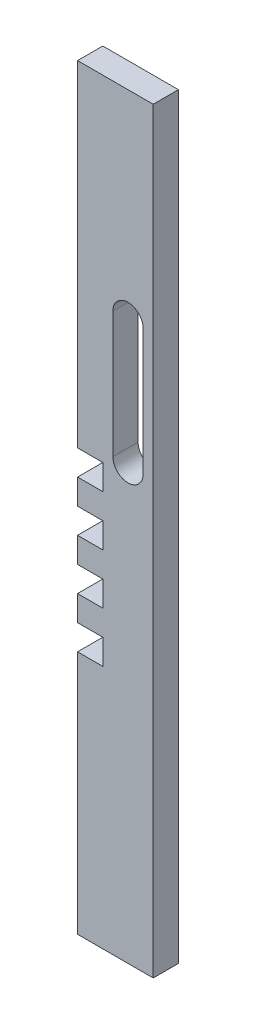
ISO-10303-21;
HEADER;
FILE_DESCRIPTION(('STEP AP214'),'2;1');
FILE_NAME('part.step','',(''),(''),'','','');
FILE_SCHEMA(('AUTOMOTIVE_DESIGN { 1 0 10303 214 1 1 1 1 }'));
ENDSEC;
DATA;
#1=APPLICATION_CONTEXT('core data for automotive mechanical design processes');
#2=APPLICATION_PROTOCOL_DEFINITION('international standard','automotive_design',2000,#1);
#3=PRODUCT_CONTEXT('',#1,'mechanical');
#4=PRODUCT('Part','Part','',(#3));
#5=PRODUCT_RELATED_PRODUCT_CATEGORY('part','',(#4));
#6=PRODUCT_DEFINITION_FORMATION('','',#4);
#7=PRODUCT_DEFINITION_CONTEXT('part definition',#1,'design');
#8=PRODUCT_DEFINITION('design','',#6,#7);
#9=PRODUCT_DEFINITION_SHAPE('','',#8);
#10=(LENGTH_UNIT() NAMED_UNIT(*) SI_UNIT(.MILLI.,.METRE.));
#11=(NAMED_UNIT(*) PLANE_ANGLE_UNIT() SI_UNIT($,.RADIAN.));
#12=(NAMED_UNIT(*) SI_UNIT($,.STERADIAN.) SOLID_ANGLE_UNIT());
#13=UNCERTAINTY_MEASURE_WITH_UNIT(LENGTH_MEASURE(1.E-05),#10,'distance_accuracy_value','');
#14=(GEOMETRIC_REPRESENTATION_CONTEXT(3) GLOBAL_UNCERTAINTY_ASSIGNED_CONTEXT((#13)) GLOBAL_UNIT_ASSIGNED_CONTEXT((#10,
#11,#12)) REPRESENTATION_CONTEXT('',''));
#15=CARTESIAN_POINT('',(0.,0.,0.));
#16=DIRECTION('',(0.,0.,1.));
#17=DIRECTION('',(1.,0.,0.));
#18=AXIS2_PLACEMENT_3D('',#15,#16,#17);
#19=CARTESIAN_POINT('',(-30.,0.,10.));
#20=DIRECTION('',(1.,0.,0.));
#21=DIRECTION('',(0.,0.,-1.));
#22=AXIS2_PLACEMENT_3D('',#19,#20,#21);
#23=PLANE('',#22);
#24=DIRECTION('',(0.,-1.,0.));
#25=VECTOR('',#24,1.);
#26=CARTESIAN_POINT('',(-30.,0.,0.));
#27=LINE('',#26,#25);
#28=CARTESIAN_POINT('',(-30.,117.,0.));
#29=VERTEX_POINT('',#28);
#30=CARTESIAN_POINT('',(-30.,107.,0.));
#31=VERTEX_POINT('',#30);
#32=EDGE_CURVE('E394',#29,#31,#27,.T.);
#33=ORIENTED_EDGE('',*,*,#32,.T.);
#34=DIRECTION('',(0.,0.,1.));
#35=VECTOR('',#34,1.);
#36=CARTESIAN_POINT('',(-30.,107.,0.));
#37=LINE('',#36,#35);
#38=CARTESIAN_POINT('',(-30.,107.,10.));
#39=VERTEX_POINT('',#38);
#40=EDGE_CURVE('E248',#31,#39,#37,.T.);
#41=ORIENTED_EDGE('',*,*,#40,.T.);
#42=DIRECTION('',(0.,-1.,0.));
#43=VECTOR('',#42,1.);
#44=CARTESIAN_POINT('',(-30.,0.,10.));
#45=LINE('',#44,#43);
#46=CARTESIAN_POINT('',(-30.,117.,10.));
#47=VERTEX_POINT('',#46);
#48=EDGE_CURVE('E420',#47,#39,#45,.T.);
#49=ORIENTED_EDGE('',*,*,#48,.F.);
#50=DIRECTION('',(0.,0.,1.));
#51=VECTOR('',#50,1.);
#52=CARTESIAN_POINT('',(-30.,117.,0.));
#53=LINE('',#52,#51);
#54=EDGE_CURVE('E267',#29,#47,#53,.T.);
#55=ORIENTED_EDGE('',*,*,#54,.F.);
#56=EDGE_LOOP('',(#33,#41,#49,#55));
#57=FACE_BOUND('',#56,.T.);
#58=ADVANCED_FACE('F33',(#57),#23,.F.);
#59=CARTESIAN_POINT('',(-30.,137.,0.));
#60=VERTEX_POINT('',#59);
#61=CARTESIAN_POINT('',(-30.,127.,0.));
#62=VERTEX_POINT('',#61);
#63=EDGE_CURVE('E396',#60,#62,#27,.T.);
#64=ORIENTED_EDGE('',*,*,#63,.T.);
#65=DIRECTION('',(0.,0.,1.));
#66=VECTOR('',#65,1.);
#67=CARTESIAN_POINT('',(-30.,127.,0.));
#68=LINE('',#67,#66);
#69=CARTESIAN_POINT('',(-30.,127.,10.));
#70=VERTEX_POINT('',#69);
#71=EDGE_CURVE('E274',#62,#70,#68,.T.);
#72=ORIENTED_EDGE('',*,*,#71,.T.);
#73=CARTESIAN_POINT('',(-30.,137.,10.));
#74=VERTEX_POINT('',#73);
#75=EDGE_CURVE('E418',#74,#70,#45,.T.);
#76=ORIENTED_EDGE('',*,*,#75,.F.);
#77=DIRECTION('',(0.,0.,1.));
#78=VECTOR('',#77,1.);
#79=CARTESIAN_POINT('',(-30.,137.,0.));
#80=LINE('',#79,#78);
#81=EDGE_CURVE('E293',#60,#74,#80,.T.);
#82=ORIENTED_EDGE('',*,*,#81,.F.);
#83=EDGE_LOOP('',(#64,#72,#76,#82));
#84=FACE_BOUND('',#83,.T.);
#85=ADVANCED_FACE('F448',(#84),#23,.F.);
#86=CARTESIAN_POINT('',(-30.,157.,0.));
#87=VERTEX_POINT('',#86);
#88=CARTESIAN_POINT('',(-30.,147.,0.));
#89=VERTEX_POINT('',#88);
#90=EDGE_CURVE('E357',#87,#89,#27,.T.);
#91=ORIENTED_EDGE('',*,*,#90,.T.);
#92=DIRECTION('',(0.,0.,1.));
#93=VECTOR('',#92,1.);
#94=CARTESIAN_POINT('',(-30.,147.,0.));
#95=LINE('',#94,#93);
#96=CARTESIAN_POINT('',(-30.,147.,10.));
#97=VERTEX_POINT('',#96);
#98=EDGE_CURVE('E300',#89,#97,#95,.T.);
#99=ORIENTED_EDGE('',*,*,#98,.T.);
#100=CARTESIAN_POINT('',(-30.,157.,10.));
#101=VERTEX_POINT('',#100);
#102=EDGE_CURVE('E346',#101,#97,#45,.T.);
#103=ORIENTED_EDGE('',*,*,#102,.F.);
#104=DIRECTION('',(0.,0.,1.));
#105=VECTOR('',#104,1.);
#106=CARTESIAN_POINT('',(-30.,157.,0.));
#107=LINE('',#106,#105);
#108=EDGE_CURVE('E319',#87,#101,#107,.T.);
#109=ORIENTED_EDGE('',*,*,#108,.F.);
#110=EDGE_LOOP('',(#91,#99,#103,#109));
#111=FACE_BOUND('',#110,.T.);
#112=ADVANCED_FACE('F408',(#111),#23,.F.);
#113=CARTESIAN_POINT('',(-30.,300.,0.));
#114=VERTEX_POINT('',#113);
#115=CARTESIAN_POINT('',(-30.,167.,0.));
#116=VERTEX_POINT('',#115);
#117=EDGE_CURVE('E354',#114,#116,#27,.T.);
#118=ORIENTED_EDGE('',*,*,#117,.T.);
#119=DIRECTION('',(0.,0.,1.));
#120=VECTOR('',#119,1.);
#121=CARTESIAN_POINT('',(-30.,167.,0.));
#122=LINE('',#121,#120);
#123=CARTESIAN_POINT('',(-30.,167.,10.));
#124=VERTEX_POINT('',#123);
#125=EDGE_CURVE('E326',#116,#124,#122,.T.);
#126=ORIENTED_EDGE('',*,*,#125,.T.);
#127=CARTESIAN_POINT('',(-30.,300.,10.));
#128=VERTEX_POINT('',#127);
#129=EDGE_CURVE('E342',#128,#124,#45,.T.);
#130=ORIENTED_EDGE('',*,*,#129,.F.);
#131=DIRECTION('',(0.,0.,-1.));
#132=VECTOR('',#131,1.);
#133=CARTESIAN_POINT('',(-30.,300.,10.));
#134=LINE('',#133,#132);
#135=EDGE_CURVE('E41',#128,#114,#134,.T.);
#136=ORIENTED_EDGE('',*,*,#135,.T.);
#137=EDGE_LOOP('',(#118,#126,#130,#136));
#138=FACE_BOUND('',#137,.T.);
#139=ADVANCED_FACE('F368',(#138),#23,.F.);
#140=CARTESIAN_POINT('',(0.,0.,10.));
#141=DIRECTION('',(-1.,0.,0.));
#142=DIRECTION('',(0.,0.,1.));
#143=AXIS2_PLACEMENT_3D('',#140,#141,#142);
#144=PLANE('',#143);
#145=DIRECTION('',(0.,1.,0.));
#146=VECTOR('',#145,1.);
#147=CARTESIAN_POINT('',(0.,0.,0.));
#148=LINE('',#147,#146);
#149=CARTESIAN_POINT('',(0.,0.,0.));
#150=VERTEX_POINT('',#149);
#151=CARTESIAN_POINT('',(0.,300.,0.));
#152=VERTEX_POINT('',#151);
#153=EDGE_CURVE('E329',#150,#152,#148,.T.);
#154=ORIENTED_EDGE('',*,*,#153,.T.);
#155=DIRECTION('',(0.,0.,-1.));
#156=VECTOR('',#155,1.);
#157=CARTESIAN_POINT('',(0.,300.,10.));
#158=LINE('',#157,#156);
#159=CARTESIAN_POINT('',(0.,300.,10.));
#160=VERTEX_POINT('',#159);
#161=EDGE_CURVE('E11',#160,#152,#158,.T.);
#162=ORIENTED_EDGE('',*,*,#161,.F.);
#163=DIRECTION('',(0.,1.,0.));
#164=VECTOR('',#163,1.);
#165=CARTESIAN_POINT('',(0.,0.,10.));
#166=LINE('',#165,#164);
#167=CARTESIAN_POINT('',(0.,0.,10.));
#168=VERTEX_POINT('',#167);
#169=EDGE_CURVE('E335',#168,#160,#166,.T.);
#170=ORIENTED_EDGE('',*,*,#169,.F.);
#171=DIRECTION('',(0.,0.,-1.));
#172=VECTOR('',#171,1.);
#173=CARTESIAN_POINT('',(0.,0.,10.));
#174=LINE('',#173,#172);
#175=EDGE_CURVE('E348',#168,#150,#174,.T.);
#176=ORIENTED_EDGE('',*,*,#175,.T.);
#177=EDGE_LOOP('',(#154,#162,#170,#176));
#178=FACE_BOUND('',#177,.T.);
#179=ADVANCED_FACE('F35',(#178),#144,.F.);
#180=CARTESIAN_POINT('',(0.,300.,10.));
#181=DIRECTION('',(0.,-1.,0.));
#182=DIRECTION('',(0.,0.,-1.));
#183=AXIS2_PLACEMENT_3D('',#180,#181,#182);
#184=PLANE('',#183);
#185=DIRECTION('',(-1.,0.,0.));
#186=VECTOR('',#185,1.);
#187=CARTESIAN_POINT('',(0.,300.,0.));
#188=LINE('',#187,#186);
#189=EDGE_CURVE('E351',#152,#114,#188,.T.);
#190=ORIENTED_EDGE('',*,*,#189,.T.);
#191=ORIENTED_EDGE('',*,*,#135,.F.);
#192=DIRECTION('',(-1.,0.,0.));
#193=VECTOR('',#192,1.);
#194=CARTESIAN_POINT('',(0.,300.,10.));
#195=LINE('',#194,#193);
#196=EDGE_CURVE('E338',#160,#128,#195,.T.);
#197=ORIENTED_EDGE('',*,*,#196,.F.);
#198=ORIENTED_EDGE('',*,*,#161,.T.);
#199=EDGE_LOOP('',(#190,#191,#197,#198));
#200=FACE_BOUND('',#199,.T.);
#201=ADVANCED_FACE('F381',(#200),#184,.F.);
#202=CARTESIAN_POINT('',(-30.,97.,10.));
#203=VERTEX_POINT('',#202);
#204=CARTESIAN_POINT('',(-30.,0.,10.));
#205=VERTEX_POINT('',#204);
#206=EDGE_CURVE('E341',#203,#205,#45,.T.);
#207=ORIENTED_EDGE('',*,*,#206,.F.);
#208=DIRECTION('',(0.,0.,1.));
#209=VECTOR('',#208,1.);
#210=CARTESIAN_POINT('',(-30.,97.,0.));
#211=LINE('',#210,#209);
#212=CARTESIAN_POINT('',(-30.,97.,0.));
#213=VERTEX_POINT('',#212);
#214=EDGE_CURVE('E241',#213,#203,#211,.T.);
#215=ORIENTED_EDGE('',*,*,#214,.F.);
#216=CARTESIAN_POINT('',(-30.,0.,0.));
#217=VERTEX_POINT('',#216);
#218=EDGE_CURVE('E353',#213,#217,#27,.T.);
#219=ORIENTED_EDGE('',*,*,#218,.T.);
#220=DIRECTION('',(0.,0.,-1.));
#221=VECTOR('',#220,1.);
#222=CARTESIAN_POINT('',(-30.,0.,10.));
#223=LINE('',#222,#221);
#224=EDGE_CURVE('E361',#205,#217,#223,.T.);
#225=ORIENTED_EDGE('',*,*,#224,.F.);
#226=EDGE_LOOP('',(#207,#215,#219,#225));
#227=FACE_BOUND('',#226,.T.);
#228=ADVANCED_FACE('F392',(#227),#23,.F.);
#229=CARTESIAN_POINT('',(0.,0.,10.));
#230=DIRECTION('',(0.,1.,0.));
#231=DIRECTION('',(0.,0.,1.));
#232=AXIS2_PLACEMENT_3D('',#229,#230,#231);
#233=PLANE('',#232);
#234=DIRECTION('',(1.,0.,0.));
#235=VECTOR('',#234,1.);
#236=CARTESIAN_POINT('',(0.,0.,0.));
#237=LINE('',#236,#235);
#238=EDGE_CURVE('E339',#217,#150,#237,.T.);
#239=ORIENTED_EDGE('',*,*,#238,.T.);
#240=ORIENTED_EDGE('',*,*,#175,.F.);
#241=DIRECTION('',(1.,0.,0.));
#242=VECTOR('',#241,1.);
#243=CARTESIAN_POINT('',(0.,0.,10.));
#244=LINE('',#243,#242);
#245=EDGE_CURVE('E345',#205,#168,#244,.T.);
#246=ORIENTED_EDGE('',*,*,#245,.F.);
#247=ORIENTED_EDGE('',*,*,#224,.T.);
#248=EDGE_LOOP('',(#239,#240,#246,#247));
#249=FACE_BOUND('',#248,.T.);
#250=ADVANCED_FACE('F387',(#249),#233,.F.);
#251=CARTESIAN_POINT('',(0.,0.,10.));
#252=DIRECTION('',(0.,0.,1.));
#253=DIRECTION('',(1.,0.,0.));
#254=AXIS2_PLACEMENT_3D('',#251,#252,#253);
#255=PLANE('',#254);
#256=CARTESIAN_POINT('',(-10.,171.,10.));
#257=DIRECTION('',(0.,0.,1.));
#258=DIRECTION('',(1.,0.,0.));
#259=AXIS2_PLACEMENT_3D('',#256,#257,#258);
#260=CIRCLE('',#259,6.);
#261=CARTESIAN_POINT('',(-16.,171.,10.));
#262=VERTEX_POINT('',#261);
#263=CARTESIAN_POINT('',(-4.,171.,10.));
#264=VERTEX_POINT('',#263);
#265=EDGE_CURVE('E48',#262,#264,#260,.T.);
#266=ORIENTED_EDGE('',*,*,#265,.F.);
#267=DIRECTION('',(0.,-1.,0.));
#268=VECTOR('',#267,1.);
#269=CARTESIAN_POINT('',(-16.,221.,10.));
#270=LINE('',#269,#268);
#271=CARTESIAN_POINT('',(-16.,221.,10.));
#272=VERTEX_POINT('',#271);
#273=EDGE_CURVE('E212',#272,#262,#270,.T.);
#274=ORIENTED_EDGE('',*,*,#273,.F.);
#275=CARTESIAN_POINT('',(-10.,221.,10.));
#276=DIRECTION('',(0.,0.,1.));
#277=DIRECTION('',(-1.,0.,0.));
#278=AXIS2_PLACEMENT_3D('',#275,#276,#277);
#279=CIRCLE('',#278,6.);
#280=CARTESIAN_POINT('',(-4.,221.,10.));
#281=VERTEX_POINT('',#280);
#282=EDGE_CURVE('E215',#281,#272,#279,.T.);
#283=ORIENTED_EDGE('',*,*,#282,.F.);
#284=DIRECTION('',(0.,1.,0.));
#285=VECTOR('',#284,1.);
#286=CARTESIAN_POINT('',(-4.,171.,10.));
#287=LINE('',#286,#285);
#288=EDGE_CURVE('E221',#264,#281,#287,.T.);
#289=ORIENTED_EDGE('',*,*,#288,.F.);
#290=EDGE_LOOP('',(#266,#274,#283,#289));
#291=FACE_BOUND('',#290,.T.);
#292=DIRECTION('',(-1.,0.,0.));
#293=VECTOR('',#292,1.);
#294=CARTESIAN_POINT('',(-30.,107.,10.));
#295=LINE('',#294,#293);
#296=CARTESIAN_POINT('',(-20.,107.,10.));
#297=VERTEX_POINT('',#296);
#298=EDGE_CURVE('E235',#297,#39,#295,.T.);
#299=ORIENTED_EDGE('',*,*,#298,.F.);
#300=DIRECTION('',(0.,1.,0.));
#301=VECTOR('',#300,1.);
#302=CARTESIAN_POINT('',(-20.,107.,10.));
#303=LINE('',#302,#301);
#304=CARTESIAN_POINT('',(-20.,97.,10.));
#305=VERTEX_POINT('',#304);
#306=EDGE_CURVE('E244',#305,#297,#303,.T.);
#307=ORIENTED_EDGE('',*,*,#306,.F.);
#308=DIRECTION('',(1.,0.,0.));
#309=VECTOR('',#308,1.);
#310=CARTESIAN_POINT('',(-30.,97.,10.));
#311=LINE('',#310,#309);
#312=EDGE_CURVE('E227',#203,#305,#311,.T.);
#313=ORIENTED_EDGE('',*,*,#312,.F.);
#314=ORIENTED_EDGE('',*,*,#206,.T.);
#315=ORIENTED_EDGE('',*,*,#245,.T.);
#316=ORIENTED_EDGE('',*,*,#169,.T.);
#317=ORIENTED_EDGE('',*,*,#196,.T.);
#318=ORIENTED_EDGE('',*,*,#129,.T.);
#319=DIRECTION('',(-1.,0.,0.));
#320=VECTOR('',#319,1.);
#321=CARTESIAN_POINT('',(-30.,167.,10.));
#322=LINE('',#321,#320);
#323=CARTESIAN_POINT('',(-20.,167.,10.));
#324=VERTEX_POINT('',#323);
#325=EDGE_CURVE('E313',#324,#124,#322,.T.);
#326=ORIENTED_EDGE('',*,*,#325,.F.);
#327=DIRECTION('',(0.,1.,0.));
#328=VECTOR('',#327,1.);
#329=CARTESIAN_POINT('',(-20.,167.,10.));
#330=LINE('',#329,#328);
#331=CARTESIAN_POINT('',(-20.,157.,10.));
#332=VERTEX_POINT('',#331);
#333=EDGE_CURVE('E322',#332,#324,#330,.T.);
#334=ORIENTED_EDGE('',*,*,#333,.F.);
#335=DIRECTION('',(1.,0.,0.));
#336=VECTOR('',#335,1.);
#337=CARTESIAN_POINT('',(-30.,157.,10.));
#338=LINE('',#337,#336);
#339=EDGE_CURVE('E303',#101,#332,#338,.T.);
#340=ORIENTED_EDGE('',*,*,#339,.F.);
#341=ORIENTED_EDGE('',*,*,#102,.T.);
#342=DIRECTION('',(-1.,0.,0.));
#343=VECTOR('',#342,1.);
#344=CARTESIAN_POINT('',(-30.,147.,10.));
#345=LINE('',#344,#343);
#346=CARTESIAN_POINT('',(-20.,147.,10.));
#347=VERTEX_POINT('',#346);
#348=EDGE_CURVE('E287',#347,#97,#345,.T.);
#349=ORIENTED_EDGE('',*,*,#348,.F.);
#350=DIRECTION('',(0.,1.,0.));
#351=VECTOR('',#350,1.);
#352=CARTESIAN_POINT('',(-20.,147.,10.));
#353=LINE('',#352,#351);
#354=CARTESIAN_POINT('',(-20.,137.,10.));
#355=VERTEX_POINT('',#354);
#356=EDGE_CURVE('E296',#355,#347,#353,.T.);
#357=ORIENTED_EDGE('',*,*,#356,.F.);
#358=DIRECTION('',(1.,0.,0.));
#359=VECTOR('',#358,1.);
#360=CARTESIAN_POINT('',(-30.,137.,10.));
#361=LINE('',#360,#359);
#362=EDGE_CURVE('E277',#74,#355,#361,.T.);
#363=ORIENTED_EDGE('',*,*,#362,.F.);
#364=ORIENTED_EDGE('',*,*,#75,.T.);
#365=DIRECTION('',(-1.,0.,0.));
#366=VECTOR('',#365,1.);
#367=CARTESIAN_POINT('',(-30.,127.,10.));
#368=LINE('',#367,#366);
#369=CARTESIAN_POINT('',(-20.,127.,10.));
#370=VERTEX_POINT('',#369);
#371=EDGE_CURVE('E261',#370,#70,#368,.T.);
#372=ORIENTED_EDGE('',*,*,#371,.F.);
#373=DIRECTION('',(0.,1.,0.));
#374=VECTOR('',#373,1.);
#375=CARTESIAN_POINT('',(-20.,127.,10.));
#376=LINE('',#375,#374);
#377=CARTESIAN_POINT('',(-20.,117.,10.));
#378=VERTEX_POINT('',#377);
#379=EDGE_CURVE('E270',#378,#370,#376,.T.);
#380=ORIENTED_EDGE('',*,*,#379,.F.);
#381=DIRECTION('',(1.,0.,0.));
#382=VECTOR('',#381,1.);
#383=CARTESIAN_POINT('',(-30.,117.,10.));
#384=LINE('',#383,#382);
#385=EDGE_CURVE('E251',#47,#378,#384,.T.);
#386=ORIENTED_EDGE('',*,*,#385,.F.);
#387=ORIENTED_EDGE('',*,*,#48,.T.);
#388=EDGE_LOOP('',(#299,#307,#313,#314,#315,#316,#317,#318,#326,#334,#340,#341,#349,#357,#363,
#364,#372,#380,#386,#387));
#389=FACE_BOUND('',#388,.T.);
#390=ADVANCED_FACE('F377',(#291,#389),#255,.T.);
#391=CARTESIAN_POINT('',(0.,0.,0.));
#392=DIRECTION('',(0.,0.,1.));
#393=DIRECTION('',(1.,0.,0.));
#394=AXIS2_PLACEMENT_3D('',#391,#392,#393);
#395=PLANE('',#394);
#396=DIRECTION('',(0.,-1.,0.));
#397=VECTOR('',#396,1.);
#398=CARTESIAN_POINT('',(-16.,221.,0.));
#399=LINE('',#398,#397);
#400=CARTESIAN_POINT('',(-16.,221.,0.));
#401=VERTEX_POINT('',#400);
#402=CARTESIAN_POINT('',(-16.,171.,0.));
#403=VERTEX_POINT('',#402);
#404=EDGE_CURVE('E202',#401,#403,#399,.T.);
#405=ORIENTED_EDGE('',*,*,#404,.T.);
#406=CARTESIAN_POINT('',(-10.,171.,0.));
#407=DIRECTION('',(0.,0.,1.));
#408=DIRECTION('',(1.,0.,0.));
#409=AXIS2_PLACEMENT_3D('',#406,#407,#408);
#410=CIRCLE('',#409,6.);
#411=CARTESIAN_POINT('',(-4.,171.,0.));
#412=VERTEX_POINT('',#411);
#413=EDGE_CURVE('E196',#403,#412,#410,.T.);
#414=ORIENTED_EDGE('',*,*,#413,.T.);
#415=DIRECTION('',(0.,1.,0.));
#416=VECTOR('',#415,1.);
#417=CARTESIAN_POINT('',(-4.,171.,0.));
#418=LINE('',#417,#416);
#419=CARTESIAN_POINT('',(-4.,221.,0.));
#420=VERTEX_POINT('',#419);
#421=EDGE_CURVE('E205',#412,#420,#418,.T.);
#422=ORIENTED_EDGE('',*,*,#421,.T.);
#423=CARTESIAN_POINT('',(-10.,221.,0.));
#424=DIRECTION('',(0.,0.,1.));
#425=DIRECTION('',(-1.,0.,0.));
#426=AXIS2_PLACEMENT_3D('',#423,#424,#425);
#427=CIRCLE('',#426,6.);
#428=EDGE_CURVE('E56',#420,#401,#427,.T.);
#429=ORIENTED_EDGE('',*,*,#428,.T.);
#430=EDGE_LOOP('',(#405,#414,#422,#429));
#431=FACE_BOUND('',#430,.T.);
#432=DIRECTION('',(0.,1.,0.));
#433=VECTOR('',#432,1.);
#434=CARTESIAN_POINT('',(-20.,107.,0.));
#435=LINE('',#434,#433);
#436=CARTESIAN_POINT('',(-20.,97.,0.));
#437=VERTEX_POINT('',#436);
#438=CARTESIAN_POINT('',(-20.,107.,0.));
#439=VERTEX_POINT('',#438);
#440=EDGE_CURVE('E234',#437,#439,#435,.T.);
#441=ORIENTED_EDGE('',*,*,#440,.T.);
#442=DIRECTION('',(-1.,0.,0.));
#443=VECTOR('',#442,1.);
#444=CARTESIAN_POINT('',(-30.,107.,0.));
#445=LINE('',#444,#443);
#446=EDGE_CURVE('E238',#439,#31,#445,.T.);
#447=ORIENTED_EDGE('',*,*,#446,.T.);
#448=ORIENTED_EDGE('',*,*,#32,.F.);
#449=DIRECTION('',(1.,0.,0.));
#450=VECTOR('',#449,1.);
#451=CARTESIAN_POINT('',(-30.,117.,0.));
#452=LINE('',#451,#450);
#453=CARTESIAN_POINT('',(-20.,117.,0.));
#454=VERTEX_POINT('',#453);
#455=EDGE_CURVE('E257',#29,#454,#452,.T.);
#456=ORIENTED_EDGE('',*,*,#455,.T.);
#457=DIRECTION('',(0.,1.,0.));
#458=VECTOR('',#457,1.);
#459=CARTESIAN_POINT('',(-20.,127.,0.));
#460=LINE('',#459,#458);
#461=CARTESIAN_POINT('',(-20.,127.,0.));
#462=VERTEX_POINT('',#461);
#463=EDGE_CURVE('E260',#454,#462,#460,.T.);
#464=ORIENTED_EDGE('',*,*,#463,.T.);
#465=DIRECTION('',(-1.,0.,0.));
#466=VECTOR('',#465,1.);
#467=CARTESIAN_POINT('',(-30.,127.,0.));
#468=LINE('',#467,#466);
#469=EDGE_CURVE('E264',#462,#62,#468,.T.);
#470=ORIENTED_EDGE('',*,*,#469,.T.);
#471=ORIENTED_EDGE('',*,*,#63,.F.);
#472=DIRECTION('',(1.,0.,0.));
#473=VECTOR('',#472,1.);
#474=CARTESIAN_POINT('',(-30.,137.,0.));
#475=LINE('',#474,#473);
#476=CARTESIAN_POINT('',(-20.,137.,0.));
#477=VERTEX_POINT('',#476);
#478=EDGE_CURVE('E283',#60,#477,#475,.T.);
#479=ORIENTED_EDGE('',*,*,#478,.T.);
#480=DIRECTION('',(0.,1.,0.));
#481=VECTOR('',#480,1.);
#482=CARTESIAN_POINT('',(-20.,147.,0.));
#483=LINE('',#482,#481);
#484=CARTESIAN_POINT('',(-20.,147.,0.));
#485=VERTEX_POINT('',#484);
#486=EDGE_CURVE('E286',#477,#485,#483,.T.);
#487=ORIENTED_EDGE('',*,*,#486,.T.);
#488=DIRECTION('',(-1.,0.,0.));
#489=VECTOR('',#488,1.);
#490=CARTESIAN_POINT('',(-30.,147.,0.));
#491=LINE('',#490,#489);
#492=EDGE_CURVE('E290',#485,#89,#491,.T.);
#493=ORIENTED_EDGE('',*,*,#492,.T.);
#494=ORIENTED_EDGE('',*,*,#90,.F.);
#495=DIRECTION('',(1.,0.,0.));
#496=VECTOR('',#495,1.);
#497=CARTESIAN_POINT('',(-30.,157.,0.));
#498=LINE('',#497,#496);
#499=CARTESIAN_POINT('',(-20.,157.,0.));
#500=VERTEX_POINT('',#499);
#501=EDGE_CURVE('E309',#87,#500,#498,.T.);
#502=ORIENTED_EDGE('',*,*,#501,.T.);
#503=DIRECTION('',(0.,1.,0.));
#504=VECTOR('',#503,1.);
#505=CARTESIAN_POINT('',(-20.,167.,0.));
#506=LINE('',#505,#504);
#507=CARTESIAN_POINT('',(-20.,167.,0.));
#508=VERTEX_POINT('',#507);
#509=EDGE_CURVE('E312',#500,#508,#506,.T.);
#510=ORIENTED_EDGE('',*,*,#509,.T.);
#511=DIRECTION('',(-1.,0.,0.));
#512=VECTOR('',#511,1.);
#513=CARTESIAN_POINT('',(-30.,167.,0.));
#514=LINE('',#513,#512);
#515=EDGE_CURVE('E316',#508,#116,#514,.T.);
#516=ORIENTED_EDGE('',*,*,#515,.T.);
#517=ORIENTED_EDGE('',*,*,#117,.F.);
#518=ORIENTED_EDGE('',*,*,#189,.F.);
#519=ORIENTED_EDGE('',*,*,#153,.F.);
#520=ORIENTED_EDGE('',*,*,#238,.F.);
#521=ORIENTED_EDGE('',*,*,#218,.F.);
#522=DIRECTION('',(1.,0.,0.));
#523=VECTOR('',#522,1.);
#524=CARTESIAN_POINT('',(-30.,97.,0.));
#525=LINE('',#524,#523);
#526=EDGE_CURVE('E231',#213,#437,#525,.T.);
#527=ORIENTED_EDGE('',*,*,#526,.T.);
#528=EDGE_LOOP('',(#441,#447,#448,#456,#464,#470,#471,#479,#487,#493,#494,#502,#510,#516,#517,
#518,#519,#520,#521,#527));
#529=FACE_BOUND('',#528,.T.);
#530=ADVANCED_FACE('F209',(#431,#529),#395,.F.);
#531=CARTESIAN_POINT('',(-30.,167.,0.));
#532=DIRECTION('',(0.,1.,0.));
#533=DIRECTION('',(-1.,0.,0.));
#534=AXIS2_PLACEMENT_3D('',#531,#532,#533);
#535=PLANE('',#534);
#536=ORIENTED_EDGE('',*,*,#325,.T.);
#537=ORIENTED_EDGE('',*,*,#125,.F.);
#538=ORIENTED_EDGE('',*,*,#515,.F.);
#539=DIRECTION('',(0.,0.,1.));
#540=VECTOR('',#539,1.);
#541=CARTESIAN_POINT('',(-20.,167.,0.));
#542=LINE('',#541,#540);
#543=EDGE_CURVE('E330',#508,#324,#542,.T.);
#544=ORIENTED_EDGE('',*,*,#543,.T.);
#545=EDGE_LOOP('',(#536,#537,#538,#544));
#546=FACE_BOUND('',#545,.T.);
#547=ADVANCED_FACE('F373',(#546),#535,.F.);
#548=CARTESIAN_POINT('',(-20.,167.,0.));
#549=DIRECTION('',(1.,0.,0.));
#550=DIRECTION('',(0.,0.,-1.));
#551=AXIS2_PLACEMENT_3D('',#548,#549,#550);
#552=PLANE('',#551);
#553=ORIENTED_EDGE('',*,*,#333,.T.);
#554=ORIENTED_EDGE('',*,*,#543,.F.);
#555=ORIENTED_EDGE('',*,*,#509,.F.);
#556=DIRECTION('',(0.,0.,1.));
#557=VECTOR('',#556,1.);
#558=CARTESIAN_POINT('',(-20.,157.,0.));
#559=LINE('',#558,#557);
#560=EDGE_CURVE('E332',#500,#332,#559,.T.);
#561=ORIENTED_EDGE('',*,*,#560,.T.);
#562=EDGE_LOOP('',(#553,#554,#555,#561));
#563=FACE_BOUND('',#562,.T.);
#564=ADVANCED_FACE('F621',(#563),#552,.F.);
#565=CARTESIAN_POINT('',(-30.,157.,0.));
#566=DIRECTION('',(0.,-1.,0.));
#567=DIRECTION('',(0.,0.,-1.));
#568=AXIS2_PLACEMENT_3D('',#565,#566,#567);
#569=PLANE('',#568);
#570=ORIENTED_EDGE('',*,*,#339,.T.);
#571=ORIENTED_EDGE('',*,*,#560,.F.);
#572=ORIENTED_EDGE('',*,*,#501,.F.);
#573=ORIENTED_EDGE('',*,*,#108,.T.);
#574=EDGE_LOOP('',(#570,#571,#572,#573));
#575=FACE_BOUND('',#574,.T.);
#576=ADVANCED_FACE('F496',(#575),#569,.F.);
#577=CARTESIAN_POINT('',(-30.,147.,0.));
#578=DIRECTION('',(0.,1.,0.));
#579=DIRECTION('',(-1.,0.,0.));
#580=AXIS2_PLACEMENT_3D('',#577,#578,#579);
#581=PLANE('',#580);
#582=ORIENTED_EDGE('',*,*,#348,.T.);
#583=ORIENTED_EDGE('',*,*,#98,.F.);
#584=ORIENTED_EDGE('',*,*,#492,.F.);
#585=DIRECTION('',(0.,0.,1.));
#586=VECTOR('',#585,1.);
#587=CARTESIAN_POINT('',(-20.,147.,0.));
#588=LINE('',#587,#586);
#589=EDGE_CURVE('E304',#485,#347,#588,.T.);
#590=ORIENTED_EDGE('',*,*,#589,.T.);
#591=EDGE_LOOP('',(#582,#583,#584,#590));
#592=FACE_BOUND('',#591,.T.);
#593=ADVANCED_FACE('F413',(#592),#581,.F.);
#594=CARTESIAN_POINT('',(-20.,147.,0.));
#595=DIRECTION('',(1.,0.,0.));
#596=DIRECTION('',(0.,0.,-1.));
#597=AXIS2_PLACEMENT_3D('',#594,#595,#596);
#598=PLANE('',#597);
#599=ORIENTED_EDGE('',*,*,#356,.T.);
#600=ORIENTED_EDGE('',*,*,#589,.F.);
#601=ORIENTED_EDGE('',*,*,#486,.F.);
#602=DIRECTION('',(0.,0.,1.));
#603=VECTOR('',#602,1.);
#604=CARTESIAN_POINT('',(-20.,137.,0.));
#605=LINE('',#604,#603);
#606=EDGE_CURVE('E306',#477,#355,#605,.T.);
#607=ORIENTED_EDGE('',*,*,#606,.T.);
#608=EDGE_LOOP('',(#599,#600,#601,#607));
#609=FACE_BOUND('',#608,.T.);
#610=ADVANCED_FACE('F495',(#609),#598,.F.);
#611=CARTESIAN_POINT('',(-30.,137.,0.));
#612=DIRECTION('',(0.,-1.,0.));
#613=DIRECTION('',(0.,0.,-1.));
#614=AXIS2_PLACEMENT_3D('',#611,#612,#613);
#615=PLANE('',#614);
#616=ORIENTED_EDGE('',*,*,#362,.T.);
#617=ORIENTED_EDGE('',*,*,#606,.F.);
#618=ORIENTED_EDGE('',*,*,#478,.F.);
#619=ORIENTED_EDGE('',*,*,#81,.T.);
#620=EDGE_LOOP('',(#616,#617,#618,#619));
#621=FACE_BOUND('',#620,.T.);
#622=ADVANCED_FACE('F447',(#621),#615,.F.);
#623=CARTESIAN_POINT('',(-30.,127.,0.));
#624=DIRECTION('',(0.,1.,0.));
#625=DIRECTION('',(-1.,0.,0.));
#626=AXIS2_PLACEMENT_3D('',#623,#624,#625);
#627=PLANE('',#626);
#628=ORIENTED_EDGE('',*,*,#371,.T.);
#629=ORIENTED_EDGE('',*,*,#71,.F.);
#630=ORIENTED_EDGE('',*,*,#469,.F.);
#631=DIRECTION('',(0.,0.,1.));
#632=VECTOR('',#631,1.);
#633=CARTESIAN_POINT('',(-20.,127.,0.));
#634=LINE('',#633,#632);
#635=EDGE_CURVE('E278',#462,#370,#634,.T.);
#636=ORIENTED_EDGE('',*,*,#635,.T.);
#637=EDGE_LOOP('',(#628,#629,#630,#636));
#638=FACE_BOUND('',#637,.T.);
#639=ADVANCED_FACE('F444',(#638),#627,.F.);
#640=CARTESIAN_POINT('',(-20.,127.,0.));
#641=DIRECTION('',(1.,0.,0.));
#642=DIRECTION('',(0.,0.,-1.));
#643=AXIS2_PLACEMENT_3D('',#640,#641,#642);
#644=PLANE('',#643);
#645=ORIENTED_EDGE('',*,*,#379,.T.);
#646=ORIENTED_EDGE('',*,*,#635,.F.);
#647=ORIENTED_EDGE('',*,*,#463,.F.);
#648=DIRECTION('',(0.,0.,1.));
#649=VECTOR('',#648,1.);
#650=CARTESIAN_POINT('',(-20.,117.,0.));
#651=LINE('',#650,#649);
#652=EDGE_CURVE('E280',#454,#378,#651,.T.);
#653=ORIENTED_EDGE('',*,*,#652,.T.);
#654=EDGE_LOOP('',(#645,#646,#647,#653));
#655=FACE_BOUND('',#654,.T.);
#656=ADVANCED_FACE('F441',(#655),#644,.F.);
#657=CARTESIAN_POINT('',(-30.,117.,0.));
#658=DIRECTION('',(0.,-1.,0.));
#659=DIRECTION('',(0.,0.,-1.));
#660=AXIS2_PLACEMENT_3D('',#657,#658,#659);
#661=PLANE('',#660);
#662=ORIENTED_EDGE('',*,*,#385,.T.);
#663=ORIENTED_EDGE('',*,*,#652,.F.);
#664=ORIENTED_EDGE('',*,*,#455,.F.);
#665=ORIENTED_EDGE('',*,*,#54,.T.);
#666=EDGE_LOOP('',(#662,#663,#664,#665));
#667=FACE_BOUND('',#666,.T.);
#668=ADVANCED_FACE('F438',(#667),#661,.F.);
#669=CARTESIAN_POINT('',(-30.,107.,0.));
#670=DIRECTION('',(0.,1.,0.));
#671=DIRECTION('',(-1.,0.,0.));
#672=AXIS2_PLACEMENT_3D('',#669,#670,#671);
#673=PLANE('',#672);
#674=ORIENTED_EDGE('',*,*,#298,.T.);
#675=ORIENTED_EDGE('',*,*,#40,.F.);
#676=ORIENTED_EDGE('',*,*,#446,.F.);
#677=DIRECTION('',(0.,0.,1.));
#678=VECTOR('',#677,1.);
#679=CARTESIAN_POINT('',(-20.,107.,0.));
#680=LINE('',#679,#678);
#681=EDGE_CURVE('E252',#439,#297,#680,.T.);
#682=ORIENTED_EDGE('',*,*,#681,.T.);
#683=EDGE_LOOP('',(#674,#675,#676,#682));
#684=FACE_BOUND('',#683,.T.);
#685=ADVANCED_FACE('F435',(#684),#673,.F.);
#686=CARTESIAN_POINT('',(-20.,107.,0.));
#687=DIRECTION('',(1.,0.,0.));
#688=DIRECTION('',(0.,0.,-1.));
#689=AXIS2_PLACEMENT_3D('',#686,#687,#688);
#690=PLANE('',#689);
#691=ORIENTED_EDGE('',*,*,#306,.T.);
#692=ORIENTED_EDGE('',*,*,#681,.F.);
#693=ORIENTED_EDGE('',*,*,#440,.F.);
#694=DIRECTION('',(0.,0.,1.));
#695=VECTOR('',#694,1.);
#696=CARTESIAN_POINT('',(-20.,97.,0.));
#697=LINE('',#696,#695);
#698=EDGE_CURVE('E254',#437,#305,#697,.T.);
#699=ORIENTED_EDGE('',*,*,#698,.T.);
#700=EDGE_LOOP('',(#691,#692,#693,#699));
#701=FACE_BOUND('',#700,.T.);
#702=ADVANCED_FACE('F433',(#701),#690,.F.);
#703=CARTESIAN_POINT('',(-30.,97.,0.));
#704=DIRECTION('',(0.,-1.,0.));
#705=DIRECTION('',(0.,0.,-1.));
#706=AXIS2_PLACEMENT_3D('',#703,#704,#705);
#707=PLANE('',#706);
#708=ORIENTED_EDGE('',*,*,#312,.T.);
#709=ORIENTED_EDGE('',*,*,#698,.F.);
#710=ORIENTED_EDGE('',*,*,#526,.F.);
#711=ORIENTED_EDGE('',*,*,#214,.T.);
#712=EDGE_LOOP('',(#708,#709,#710,#711));
#713=FACE_BOUND('',#712,.T.);
#714=ADVANCED_FACE('F430',(#713),#707,.F.);
#715=CARTESIAN_POINT('',(-10.,171.,0.));
#716=DIRECTION('',(0.,0.,1.));
#717=DIRECTION('',(1.,0.,0.));
#718=AXIS2_PLACEMENT_3D('',#715,#716,#717);
#719=CYLINDRICAL_SURFACE('',#718,6.);
#720=ORIENTED_EDGE('',*,*,#265,.T.);
#721=DIRECTION('',(0.,0.,1.));
#722=VECTOR('',#721,1.);
#723=CARTESIAN_POINT('',(-4.,171.,0.));
#724=LINE('',#723,#722);
#725=EDGE_CURVE('E192',#412,#264,#724,.T.);
#726=ORIENTED_EDGE('',*,*,#725,.F.);
#727=ORIENTED_EDGE('',*,*,#413,.F.);
#728=DIRECTION('',(0.,0.,1.));
#729=VECTOR('',#728,1.);
#730=CARTESIAN_POINT('',(-16.,171.,0.));
#731=LINE('',#730,#729);
#732=EDGE_CURVE('E225',#403,#262,#731,.T.);
#733=ORIENTED_EDGE('',*,*,#732,.T.);
#734=EDGE_LOOP('',(#720,#726,#727,#733));
#735=FACE_BOUND('',#734,.T.);
#736=ADVANCED_FACE('F194',(#735),#719,.F.);
#737=CARTESIAN_POINT('',(-16.,221.,0.));
#738=DIRECTION('',(-1.,0.,0.));
#739=DIRECTION('',(0.,-1.,0.));
#740=AXIS2_PLACEMENT_3D('',#737,#738,#739);
#741=PLANE('',#740);
#742=ORIENTED_EDGE('',*,*,#273,.T.);
#743=ORIENTED_EDGE('',*,*,#732,.F.);
#744=ORIENTED_EDGE('',*,*,#404,.F.);
#745=DIRECTION('',(0.,0.,1.));
#746=VECTOR('',#745,1.);
#747=CARTESIAN_POINT('',(-16.,221.,0.));
#748=LINE('',#747,#746);
#749=EDGE_CURVE('E228',#401,#272,#748,.T.);
#750=ORIENTED_EDGE('',*,*,#749,.T.);
#751=EDGE_LOOP('',(#742,#743,#744,#750));
#752=FACE_BOUND('',#751,.T.);
#753=ADVANCED_FACE('F589',(#752),#741,.F.);
#754=CARTESIAN_POINT('',(-10.,221.,0.));
#755=DIRECTION('',(0.,0.,1.));
#756=DIRECTION('',(1.,0.,0.));
#757=AXIS2_PLACEMENT_3D('',#754,#755,#756);
#758=CYLINDRICAL_SURFACE('',#757,6.);
#759=ORIENTED_EDGE('',*,*,#282,.T.);
#760=ORIENTED_EDGE('',*,*,#749,.F.);
#761=ORIENTED_EDGE('',*,*,#428,.F.);
#762=DIRECTION('',(0.,0.,1.));
#763=VECTOR('',#762,1.);
#764=CARTESIAN_POINT('',(-4.,221.,0.));
#765=LINE('',#764,#763);
#766=EDGE_CURVE('E201',#420,#281,#765,.T.);
#767=ORIENTED_EDGE('',*,*,#766,.T.);
#768=EDGE_LOOP('',(#759,#760,#761,#767));
#769=FACE_BOUND('',#768,.T.);
#770=ADVANCED_FACE('F598',(#769),#758,.F.);
#771=CARTESIAN_POINT('',(-4.,171.,0.));
#772=DIRECTION('',(1.,0.,0.));
#773=DIRECTION('',(0.,0.,-1.));
#774=AXIS2_PLACEMENT_3D('',#771,#772,#773);
#775=PLANE('',#774);
#776=ORIENTED_EDGE('',*,*,#288,.T.);
#777=ORIENTED_EDGE('',*,*,#766,.F.);
#778=ORIENTED_EDGE('',*,*,#421,.F.);
#779=ORIENTED_EDGE('',*,*,#725,.T.);
#780=EDGE_LOOP('',(#776,#777,#778,#779));
#781=FACE_BOUND('',#780,.T.);
#782=ADVANCED_FACE('F206',(#781),#775,.F.);
#783=CLOSED_SHELL('',(#58,#85,#112,#139,#179,#201,#228,#250,#390,#530,#547,#564,#576,#593,#610,
#622,#639,#656,#668,#685,#702,#714,#736,#753,#770,#782));
#784=MANIFOLD_SOLID_BREP('B2',#783);
#785=ADVANCED_BREP_SHAPE_REPRESENTATION('',(#18,#784),#14);
#786=SHAPE_DEFINITION_REPRESENTATION(#9,#785);
ENDSEC;
END-ISO-10303-21;
